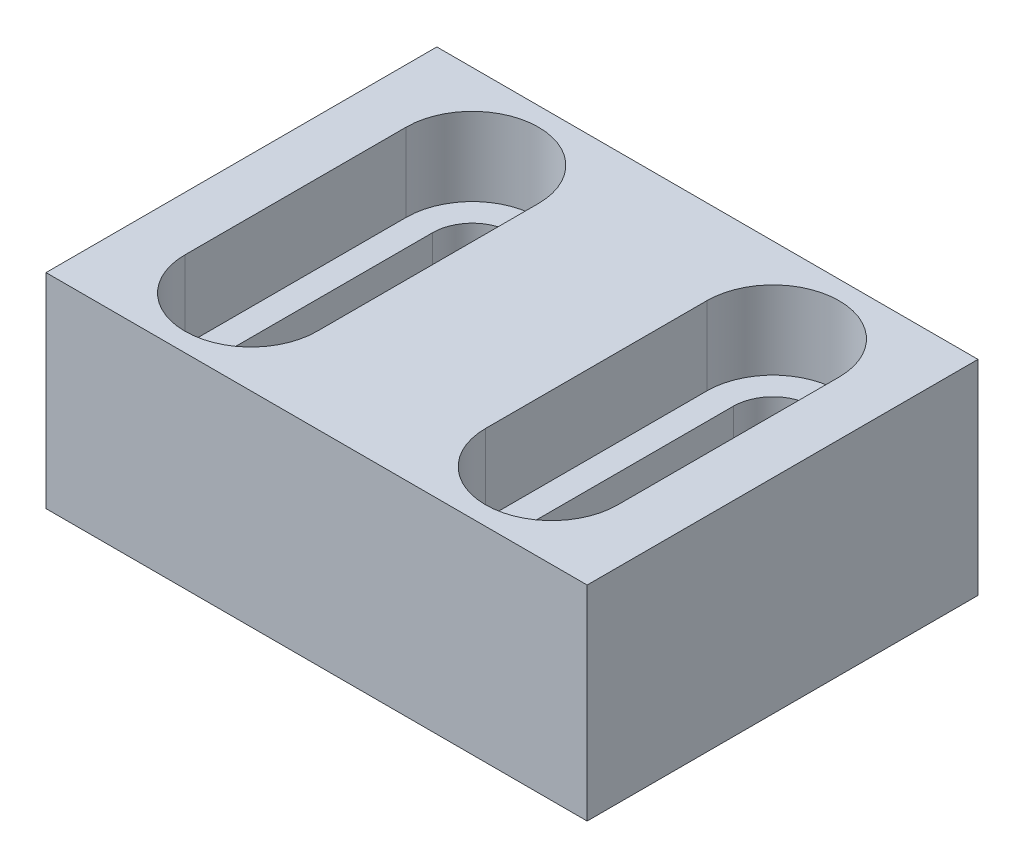
ISO-10303-21;
HEADER;
FILE_DESCRIPTION(('STEP AP214'),'2;1');
FILE_NAME('part.step','',(''),(''),'','','');
FILE_SCHEMA(('AUTOMOTIVE_DESIGN { 1 0 10303 214 1 1 1 1 }'));
ENDSEC;
DATA;
#1=APPLICATION_CONTEXT('core data for automotive mechanical design processes');
#2=APPLICATION_PROTOCOL_DEFINITION('international standard','automotive_design',2000,#1);
#3=PRODUCT_CONTEXT('',#1,'mechanical');
#4=PRODUCT('Part','Part','',(#3));
#5=PRODUCT_RELATED_PRODUCT_CATEGORY('part','',(#4));
#6=PRODUCT_DEFINITION_FORMATION('','',#4);
#7=PRODUCT_DEFINITION_CONTEXT('part definition',#1,'design');
#8=PRODUCT_DEFINITION('design','',#6,#7);
#9=PRODUCT_DEFINITION_SHAPE('','',#8);
#10=(LENGTH_UNIT() NAMED_UNIT(*) SI_UNIT(.MILLI.,.METRE.));
#11=(NAMED_UNIT(*) PLANE_ANGLE_UNIT() SI_UNIT($,.RADIAN.));
#12=(NAMED_UNIT(*) SI_UNIT($,.STERADIAN.) SOLID_ANGLE_UNIT());
#13=UNCERTAINTY_MEASURE_WITH_UNIT(LENGTH_MEASURE(1.E-05),#10,'distance_accuracy_value','');
#14=(GEOMETRIC_REPRESENTATION_CONTEXT(3) GLOBAL_UNCERTAINTY_ASSIGNED_CONTEXT((#13)) GLOBAL_UNIT_ASSIGNED_CONTEXT((#10,
#11,#12)) REPRESENTATION_CONTEXT('',''));
#15=CARTESIAN_POINT('',(0.,0.,0.));
#16=DIRECTION('',(0.,0.,1.));
#17=DIRECTION('',(1.,0.,0.));
#18=AXIS2_PLACEMENT_3D('',#15,#16,#17);
#19=CARTESIAN_POINT('',(-12.5,17.,9.2));
#20=DIRECTION('',(0.,-1.,0.));
#21=DIRECTION('',(0.,0.,-1.));
#22=AXIS2_PLACEMENT_3D('',#19,#20,#21);
#23=CYLINDRICAL_SURFACE('',#22,3.3);
#24=DIRECTION('',(0.,-1.,0.));
#25=VECTOR('',#24,1.);
#26=CARTESIAN_POINT('',(-15.8,17.,9.2));
#27=LINE('',#26,#25);
#28=CARTESIAN_POINT('',(-15.8,10.5,9.2));
#29=VERTEX_POINT('',#28);
#30=CARTESIAN_POINT('',(-15.8,0.,9.2));
#31=VERTEX_POINT('',#30);
#32=EDGE_CURVE('E372',#29,#31,#27,.T.);
#33=ORIENTED_EDGE('',*,*,#32,.F.);
#34=CARTESIAN_POINT('',(-12.5,10.5,9.2));
#35=DIRECTION('',(0.,1.,0.));
#36=DIRECTION('',(0.,0.,1.));
#37=AXIS2_PLACEMENT_3D('',#34,#35,#36);
#38=CIRCLE('',#37,3.3);
#39=CARTESIAN_POINT('',(-9.2,10.5,9.2));
#40=VERTEX_POINT('',#39);
#41=EDGE_CURVE('E324',#29,#40,#38,.T.);
#42=ORIENTED_EDGE('',*,*,#41,.T.);
#43=DIRECTION('',(0.,-1.,0.));
#44=VECTOR('',#43,1.);
#45=CARTESIAN_POINT('',(-9.2,17.,9.2));
#46=LINE('',#45,#44);
#47=CARTESIAN_POINT('',(-9.2,0.,9.2));
#48=VERTEX_POINT('',#47);
#49=EDGE_CURVE('E381',#40,#48,#46,.T.);
#50=ORIENTED_EDGE('',*,*,#49,.T.);
#51=CARTESIAN_POINT('',(-12.5,0.,9.2));
#52=DIRECTION('',(0.,1.,0.));
#53=DIRECTION('',(0.,0.,1.));
#54=AXIS2_PLACEMENT_3D('',#51,#52,#53);
#55=CIRCLE('',#54,3.3);
#56=EDGE_CURVE('E356',#31,#48,#55,.T.);
#57=ORIENTED_EDGE('',*,*,#56,.F.);
#58=EDGE_LOOP('',(#33,#42,#50,#57));
#59=FACE_BOUND('',#58,.T.);
#60=ADVANCED_FACE('F42',(#59),#23,.F.);
#61=CARTESIAN_POINT('',(-9.2,17.,9.2));
#62=DIRECTION('',(-1.,0.,0.));
#63=DIRECTION('',(0.,0.,1.));
#64=AXIS2_PLACEMENT_3D('',#61,#62,#63);
#65=PLANE('',#64);
#66=ORIENTED_EDGE('',*,*,#49,.F.);
#67=DIRECTION('',(0.,0.,-1.));
#68=VECTOR('',#67,1.);
#69=CARTESIAN_POINT('',(-9.2,10.5,9.2));
#70=LINE('',#69,#68);
#71=CARTESIAN_POINT('',(-9.2,10.5,-9.2));
#72=VERTEX_POINT('',#71);
#73=EDGE_CURVE('E320',#40,#72,#70,.T.);
#74=ORIENTED_EDGE('',*,*,#73,.T.);
#75=DIRECTION('',(0.,-1.,0.));
#76=VECTOR('',#75,1.);
#77=CARTESIAN_POINT('',(-9.2,17.,-9.2));
#78=LINE('',#77,#76);
#79=CARTESIAN_POINT('',(-9.2,0.,-9.2));
#80=VERTEX_POINT('',#79);
#81=EDGE_CURVE('E378',#72,#80,#78,.T.);
#82=ORIENTED_EDGE('',*,*,#81,.T.);
#83=DIRECTION('',(0.,0.,-1.));
#84=VECTOR('',#83,1.);
#85=CARTESIAN_POINT('',(-9.2,0.,9.2));
#86=LINE('',#85,#84);
#87=EDGE_CURVE('E360',#48,#80,#86,.T.);
#88=ORIENTED_EDGE('',*,*,#87,.F.);
#89=EDGE_LOOP('',(#66,#74,#82,#88));
#90=FACE_BOUND('',#89,.T.);
#91=ADVANCED_FACE('F458',(#90),#65,.T.);
#92=CARTESIAN_POINT('',(-12.5,17.,-9.2));
#93=DIRECTION('',(0.,-1.,0.));
#94=DIRECTION('',(0.,0.,-1.));
#95=AXIS2_PLACEMENT_3D('',#92,#93,#94);
#96=CYLINDRICAL_SURFACE('',#95,3.3);
#97=ORIENTED_EDGE('',*,*,#81,.F.);
#98=CARTESIAN_POINT('',(-12.5,10.5,-9.2));
#99=DIRECTION('',(0.,1.,0.));
#100=DIRECTION('',(0.,0.,1.));
#101=AXIS2_PLACEMENT_3D('',#98,#99,#100);
#102=CIRCLE('',#101,3.3);
#103=CARTESIAN_POINT('',(-15.8,10.5,-9.2));
#104=VERTEX_POINT('',#103);
#105=EDGE_CURVE('E316',#72,#104,#102,.T.);
#106=ORIENTED_EDGE('',*,*,#105,.T.);
#107=DIRECTION('',(0.,-1.,0.));
#108=VECTOR('',#107,1.);
#109=CARTESIAN_POINT('',(-15.8,17.,-9.2));
#110=LINE('',#109,#108);
#111=CARTESIAN_POINT('',(-15.8,0.,-9.2));
#112=VERTEX_POINT('',#111);
#113=EDGE_CURVE('E375',#104,#112,#110,.T.);
#114=ORIENTED_EDGE('',*,*,#113,.T.);
#115=CARTESIAN_POINT('',(-12.5,0.,-9.2));
#116=DIRECTION('',(0.,1.,0.));
#117=DIRECTION('',(0.,0.,1.));
#118=AXIS2_PLACEMENT_3D('',#115,#116,#117);
#119=CIRCLE('',#118,3.3);
#120=EDGE_CURVE('E364',#80,#112,#119,.T.);
#121=ORIENTED_EDGE('',*,*,#120,.F.);
#122=EDGE_LOOP('',(#97,#106,#114,#121));
#123=FACE_BOUND('',#122,.T.);
#124=ADVANCED_FACE('F464',(#123),#96,.F.);
#125=CARTESIAN_POINT('',(-15.8,17.,9.2));
#126=DIRECTION('',(1.,0.,0.));
#127=DIRECTION('',(0.,0.,-1.));
#128=AXIS2_PLACEMENT_3D('',#125,#126,#127);
#129=PLANE('',#128);
#130=ORIENTED_EDGE('',*,*,#113,.F.);
#131=DIRECTION('',(0.,0.,1.));
#132=VECTOR('',#131,1.);
#133=CARTESIAN_POINT('',(-15.8,10.5,9.2));
#134=LINE('',#133,#132);
#135=EDGE_CURVE('E11',#104,#29,#134,.T.);
#136=ORIENTED_EDGE('',*,*,#135,.T.);
#137=ORIENTED_EDGE('',*,*,#32,.T.);
#138=DIRECTION('',(0.,0.,1.));
#139=VECTOR('',#138,1.);
#140=CARTESIAN_POINT('',(-15.8,0.,9.2));
#141=LINE('',#140,#139);
#142=EDGE_CURVE('E368',#112,#31,#141,.T.);
#143=ORIENTED_EDGE('',*,*,#142,.F.);
#144=EDGE_LOOP('',(#130,#136,#137,#143));
#145=FACE_BOUND('',#144,.T.);
#146=ADVANCED_FACE('F455',(#145),#129,.T.);
#147=CARTESIAN_POINT('',(12.5,17.,9.2));
#148=DIRECTION('',(0.,-1.,0.));
#149=DIRECTION('',(0.,0.,-1.));
#150=AXIS2_PLACEMENT_3D('',#147,#148,#149);
#151=CYLINDRICAL_SURFACE('',#150,3.3);
#152=DIRECTION('',(0.,-1.,0.));
#153=VECTOR('',#152,1.);
#154=CARTESIAN_POINT('',(9.2,17.,9.2));
#155=LINE('',#154,#153);
#156=CARTESIAN_POINT('',(9.2,10.5,9.2));
#157=VERTEX_POINT('',#156);
#158=CARTESIAN_POINT('',(9.2,0.,9.2));
#159=VERTEX_POINT('',#158);
#160=EDGE_CURVE('E344',#157,#159,#155,.T.);
#161=ORIENTED_EDGE('',*,*,#160,.F.);
#162=CARTESIAN_POINT('',(12.5,10.5,9.2));
#163=DIRECTION('',(0.,1.,0.));
#164=DIRECTION('',(0.,0.,1.));
#165=AXIS2_PLACEMENT_3D('',#162,#163,#164);
#166=CIRCLE('',#165,3.3);
#167=CARTESIAN_POINT('',(15.8,10.5,9.2));
#168=VERTEX_POINT('',#167);
#169=EDGE_CURVE('E312',#157,#168,#166,.T.);
#170=ORIENTED_EDGE('',*,*,#169,.T.);
#171=DIRECTION('',(0.,-1.,0.));
#172=VECTOR('',#171,1.);
#173=CARTESIAN_POINT('',(15.8,17.,9.2));
#174=LINE('',#173,#172);
#175=CARTESIAN_POINT('',(15.8,0.,9.2));
#176=VERTEX_POINT('',#175);
#177=EDGE_CURVE('E353',#168,#176,#174,.T.);
#178=ORIENTED_EDGE('',*,*,#177,.T.);
#179=CARTESIAN_POINT('',(12.5,0.,9.2));
#180=DIRECTION('',(0.,1.,0.));
#181=DIRECTION('',(0.,0.,1.));
#182=AXIS2_PLACEMENT_3D('',#179,#180,#181);
#183=CIRCLE('',#182,3.3);
#184=EDGE_CURVE('E328',#159,#176,#183,.T.);
#185=ORIENTED_EDGE('',*,*,#184,.F.);
#186=EDGE_LOOP('',(#161,#170,#178,#185));
#187=FACE_BOUND('',#186,.T.);
#188=ADVANCED_FACE('F435',(#187),#151,.F.);
#189=CARTESIAN_POINT('',(15.8,17.,9.2));
#190=DIRECTION('',(-1.,0.,0.));
#191=DIRECTION('',(0.,0.,1.));
#192=AXIS2_PLACEMENT_3D('',#189,#190,#191);
#193=PLANE('',#192);
#194=ORIENTED_EDGE('',*,*,#177,.F.);
#195=DIRECTION('',(0.,0.,-1.));
#196=VECTOR('',#195,1.);
#197=CARTESIAN_POINT('',(15.8,10.5,9.2));
#198=LINE('',#197,#196);
#199=CARTESIAN_POINT('',(15.8,10.5,-9.2));
#200=VERTEX_POINT('',#199);
#201=EDGE_CURVE('E308',#168,#200,#198,.T.);
#202=ORIENTED_EDGE('',*,*,#201,.T.);
#203=DIRECTION('',(0.,-1.,0.));
#204=VECTOR('',#203,1.);
#205=CARTESIAN_POINT('',(15.8,17.,-9.2));
#206=LINE('',#205,#204);
#207=CARTESIAN_POINT('',(15.8,0.,-9.2));
#208=VERTEX_POINT('',#207);
#209=EDGE_CURVE('E350',#200,#208,#206,.T.);
#210=ORIENTED_EDGE('',*,*,#209,.T.);
#211=DIRECTION('',(0.,0.,-1.));
#212=VECTOR('',#211,1.);
#213=CARTESIAN_POINT('',(15.8,0.,9.2));
#214=LINE('',#213,#212);
#215=EDGE_CURVE('E332',#176,#208,#214,.T.);
#216=ORIENTED_EDGE('',*,*,#215,.F.);
#217=EDGE_LOOP('',(#194,#202,#210,#216));
#218=FACE_BOUND('',#217,.T.);
#219=ADVANCED_FACE('F447',(#218),#193,.T.);
#220=CARTESIAN_POINT('',(12.5,17.,-9.2));
#221=DIRECTION('',(0.,-1.,0.));
#222=DIRECTION('',(0.,0.,-1.));
#223=AXIS2_PLACEMENT_3D('',#220,#221,#222);
#224=CYLINDRICAL_SURFACE('',#223,3.3);
#225=ORIENTED_EDGE('',*,*,#209,.F.);
#226=CARTESIAN_POINT('',(12.5,10.5,-9.2));
#227=DIRECTION('',(0.,1.,0.));
#228=DIRECTION('',(0.,0.,1.));
#229=AXIS2_PLACEMENT_3D('',#226,#227,#228);
#230=CIRCLE('',#229,3.3);
#231=CARTESIAN_POINT('',(9.2,10.5,-9.2));
#232=VERTEX_POINT('',#231);
#233=EDGE_CURVE('E255',#200,#232,#230,.T.);
#234=ORIENTED_EDGE('',*,*,#233,.T.);
#235=DIRECTION('',(0.,-1.,0.));
#236=VECTOR('',#235,1.);
#237=CARTESIAN_POINT('',(9.2,17.,-9.2));
#238=LINE('',#237,#236);
#239=CARTESIAN_POINT('',(9.2,0.,-9.2));
#240=VERTEX_POINT('',#239);
#241=EDGE_CURVE('E347',#232,#240,#238,.T.);
#242=ORIENTED_EDGE('',*,*,#241,.T.);
#243=CARTESIAN_POINT('',(12.5,0.,-9.2));
#244=DIRECTION('',(0.,1.,0.));
#245=DIRECTION('',(0.,0.,1.));
#246=AXIS2_PLACEMENT_3D('',#243,#244,#245);
#247=CIRCLE('',#246,3.3);
#248=EDGE_CURVE('E336',#208,#240,#247,.T.);
#249=ORIENTED_EDGE('',*,*,#248,.F.);
#250=EDGE_LOOP('',(#225,#234,#242,#249));
#251=FACE_BOUND('',#250,.T.);
#252=ADVANCED_FACE('F443',(#251),#224,.F.);
#253=CARTESIAN_POINT('',(9.2,17.,9.2));
#254=DIRECTION('',(1.,0.,0.));
#255=DIRECTION('',(0.,0.,-1.));
#256=AXIS2_PLACEMENT_3D('',#253,#254,#255);
#257=PLANE('',#256);
#258=ORIENTED_EDGE('',*,*,#241,.F.);
#259=DIRECTION('',(0.,0.,1.));
#260=VECTOR('',#259,1.);
#261=CARTESIAN_POINT('',(9.2,10.5,9.2));
#262=LINE('',#261,#260);
#263=EDGE_CURVE('E51',#232,#157,#262,.T.);
#264=ORIENTED_EDGE('',*,*,#263,.T.);
#265=ORIENTED_EDGE('',*,*,#160,.T.);
#266=DIRECTION('',(0.,0.,1.));
#267=VECTOR('',#266,1.);
#268=CARTESIAN_POINT('',(9.2,0.,9.2));
#269=LINE('',#268,#267);
#270=EDGE_CURVE('E340',#240,#159,#269,.T.);
#271=ORIENTED_EDGE('',*,*,#270,.F.);
#272=EDGE_LOOP('',(#258,#264,#265,#271));
#273=FACE_BOUND('',#272,.T.);
#274=ADVANCED_FACE('F430',(#273),#257,.T.);
#275=CARTESIAN_POINT('',(0.,17.,0.));
#276=DIRECTION('',(0.,-1.,0.));
#277=DIRECTION('',(0.,0.,-1.));
#278=AXIS2_PLACEMENT_3D('',#275,#276,#277);
#279=PLANE('',#278);
#280=DIRECTION('',(0.,0.,-1.));
#281=VECTOR('',#280,1.);
#282=CARTESIAN_POINT('',(18.,17.,9.2));
#283=LINE('',#282,#281);
#284=CARTESIAN_POINT('',(18.,17.,9.2));
#285=VERTEX_POINT('',#284);
#286=CARTESIAN_POINT('',(18.,17.,-9.2));
#287=VERTEX_POINT('',#286);
#288=EDGE_CURVE('E240',#285,#287,#283,.T.);
#289=ORIENTED_EDGE('',*,*,#288,.F.);
#290=CARTESIAN_POINT('',(12.5,17.,9.2));
#291=DIRECTION('',(0.,1.,0.));
#292=DIRECTION('',(0.,0.,1.));
#293=AXIS2_PLACEMENT_3D('',#290,#291,#292);
#294=CIRCLE('',#293,5.5);
#295=CARTESIAN_POINT('',(7.,17.,9.2));
#296=VERTEX_POINT('',#295);
#297=EDGE_CURVE('E58',#296,#285,#294,.T.);
#298=ORIENTED_EDGE('',*,*,#297,.F.);
#299=DIRECTION('',(0.,0.,1.));
#300=VECTOR('',#299,1.);
#301=CARTESIAN_POINT('',(7.,17.,-9.2));
#302=LINE('',#301,#300);
#303=CARTESIAN_POINT('',(7.,17.,-9.2));
#304=VERTEX_POINT('',#303);
#305=EDGE_CURVE('E225',#304,#296,#302,.T.);
#306=ORIENTED_EDGE('',*,*,#305,.F.);
#307=CARTESIAN_POINT('',(12.5,17.,-9.2));
#308=DIRECTION('',(0.,1.,0.));
#309=DIRECTION('',(0.,0.,1.));
#310=AXIS2_PLACEMENT_3D('',#307,#308,#309);
#311=CIRCLE('',#310,5.5);
#312=EDGE_CURVE('E245',#287,#304,#311,.T.);
#313=ORIENTED_EDGE('',*,*,#312,.F.);
#314=EDGE_LOOP('',(#289,#298,#306,#313));
#315=FACE_BOUND('',#314,.T.);
#316=DIRECTION('',(0.,0.,-1.));
#317=VECTOR('',#316,1.);
#318=CARTESIAN_POINT('',(-7.,17.,9.2));
#319=LINE('',#318,#317);
#320=CARTESIAN_POINT('',(-7.,17.,9.2));
#321=VERTEX_POINT('',#320);
#322=CARTESIAN_POINT('',(-7.,17.,-9.2));
#323=VERTEX_POINT('',#322);
#324=EDGE_CURVE('E284',#321,#323,#319,.T.);
#325=ORIENTED_EDGE('',*,*,#324,.F.);
#326=CARTESIAN_POINT('',(-12.5,17.,9.2));
#327=DIRECTION('',(0.,1.,0.));
#328=DIRECTION('',(0.,0.,1.));
#329=AXIS2_PLACEMENT_3D('',#326,#327,#328);
#330=CIRCLE('',#329,5.50000000000001);
#331=CARTESIAN_POINT('',(-18.,17.,9.2));
#332=VERTEX_POINT('',#331);
#333=EDGE_CURVE('E66',#332,#321,#330,.T.);
#334=ORIENTED_EDGE('',*,*,#333,.F.);
#335=DIRECTION('',(0.,0.,1.));
#336=VECTOR('',#335,1.);
#337=CARTESIAN_POINT('',(-18.,17.,-9.2));
#338=LINE('',#337,#336);
#339=CARTESIAN_POINT('',(-18.,17.,-9.2));
#340=VERTEX_POINT('',#339);
#341=EDGE_CURVE('E269',#340,#332,#338,.T.);
#342=ORIENTED_EDGE('',*,*,#341,.F.);
#343=CARTESIAN_POINT('',(-12.5,17.,-9.2));
#344=DIRECTION('',(0.,1.,0.));
#345=DIRECTION('',(0.,0.,1.));
#346=AXIS2_PLACEMENT_3D('',#343,#344,#345);
#347=CIRCLE('',#346,5.50000000000001);
#348=EDGE_CURVE('E288',#323,#340,#347,.T.);
#349=ORIENTED_EDGE('',*,*,#348,.F.);
#350=EDGE_LOOP('',(#325,#334,#342,#349));
#351=FACE_BOUND('',#350,.T.);
#352=DIRECTION('',(0.,0.,-1.));
#353=VECTOR('',#352,1.);
#354=CARTESIAN_POINT('',(22.5,17.,16.25));
#355=LINE('',#354,#353);
#356=CARTESIAN_POINT('',(22.5,17.,16.25));
#357=VERTEX_POINT('',#356);
#358=CARTESIAN_POINT('',(22.5,17.,-16.25));
#359=VERTEX_POINT('',#358);
#360=EDGE_CURVE('E385',#357,#359,#355,.T.);
#361=ORIENTED_EDGE('',*,*,#360,.T.);
#362=DIRECTION('',(-1.,0.,0.));
#363=VECTOR('',#362,1.);
#364=CARTESIAN_POINT('',(-22.5,17.,-16.25));
#365=LINE('',#364,#363);
#366=CARTESIAN_POINT('',(-22.5,17.,-16.25));
#367=VERTEX_POINT('',#366);
#368=EDGE_CURVE('E389',#359,#367,#365,.T.);
#369=ORIENTED_EDGE('',*,*,#368,.T.);
#370=DIRECTION('',(0.,0.,1.));
#371=VECTOR('',#370,1.);
#372=CARTESIAN_POINT('',(-22.5,17.,16.25));
#373=LINE('',#372,#371);
#374=CARTESIAN_POINT('',(-22.5,17.,16.25));
#375=VERTEX_POINT('',#374);
#376=EDGE_CURVE('E393',#367,#375,#373,.T.);
#377=ORIENTED_EDGE('',*,*,#376,.T.);
#378=DIRECTION('',(1.,0.,0.));
#379=VECTOR('',#378,1.);
#380=CARTESIAN_POINT('',(-22.5,17.,16.25));
#381=LINE('',#380,#379);
#382=EDGE_CURVE('E396',#375,#357,#381,.T.);
#383=ORIENTED_EDGE('',*,*,#382,.T.);
#384=EDGE_LOOP('',(#361,#369,#377,#383));
#385=FACE_BOUND('',#384,.T.);
#386=ADVANCED_FACE('F470',(#315,#351,#385),#279,.F.);
#387=CARTESIAN_POINT('',(0.,0.,0.));
#388=DIRECTION('',(0.,-1.,0.));
#389=DIRECTION('',(0.,0.,-1.));
#390=AXIS2_PLACEMENT_3D('',#387,#388,#389);
#391=PLANE('',#390);
#392=DIRECTION('',(0.,0.,-1.));
#393=VECTOR('',#392,1.);
#394=CARTESIAN_POINT('',(22.5,0.,16.25));
#395=LINE('',#394,#393);
#396=CARTESIAN_POINT('',(22.5,0.,16.25));
#397=VERTEX_POINT('',#396);
#398=CARTESIAN_POINT('',(22.5,0.,-16.25));
#399=VERTEX_POINT('',#398);
#400=EDGE_CURVE('E384',#397,#399,#395,.T.);
#401=ORIENTED_EDGE('',*,*,#400,.F.);
#402=DIRECTION('',(1.,0.,0.));
#403=VECTOR('',#402,1.);
#404=CARTESIAN_POINT('',(-22.5,0.,16.25));
#405=LINE('',#404,#403);
#406=CARTESIAN_POINT('',(-22.5,0.,16.25));
#407=VERTEX_POINT('',#406);
#408=EDGE_CURVE('E390',#407,#397,#405,.T.);
#409=ORIENTED_EDGE('',*,*,#408,.F.);
#410=DIRECTION('',(0.,0.,1.));
#411=VECTOR('',#410,1.);
#412=CARTESIAN_POINT('',(-22.5,0.,16.25));
#413=LINE('',#412,#411);
#414=CARTESIAN_POINT('',(-22.5,0.,-16.25));
#415=VERTEX_POINT('',#414);
#416=EDGE_CURVE('E406',#415,#407,#413,.T.);
#417=ORIENTED_EDGE('',*,*,#416,.F.);
#418=DIRECTION('',(-1.,0.,0.));
#419=VECTOR('',#418,1.);
#420=CARTESIAN_POINT('',(-22.5,0.,-16.25));
#421=LINE('',#420,#419);
#422=EDGE_CURVE('E403',#399,#415,#421,.T.);
#423=ORIENTED_EDGE('',*,*,#422,.F.);
#424=EDGE_LOOP('',(#401,#409,#417,#423));
#425=FACE_BOUND('',#424,.T.);
#426=ORIENTED_EDGE('',*,*,#142,.T.);
#427=ORIENTED_EDGE('',*,*,#56,.T.);
#428=ORIENTED_EDGE('',*,*,#87,.T.);
#429=ORIENTED_EDGE('',*,*,#120,.T.);
#430=EDGE_LOOP('',(#426,#427,#428,#429));
#431=FACE_BOUND('',#430,.T.);
#432=ORIENTED_EDGE('',*,*,#270,.T.);
#433=ORIENTED_EDGE('',*,*,#184,.T.);
#434=ORIENTED_EDGE('',*,*,#215,.T.);
#435=ORIENTED_EDGE('',*,*,#248,.T.);
#436=EDGE_LOOP('',(#432,#433,#434,#435));
#437=FACE_BOUND('',#436,.T.);
#438=ADVANCED_FACE('F439',(#425,#431,#437),#391,.T.);
#439=CARTESIAN_POINT('',(22.5,17.,16.25));
#440=DIRECTION('',(-1.,0.,0.));
#441=DIRECTION('',(0.,0.,1.));
#442=AXIS2_PLACEMENT_3D('',#439,#440,#441);
#443=PLANE('',#442);
#444=ORIENTED_EDGE('',*,*,#400,.T.);
#445=DIRECTION('',(0.,-1.,0.));
#446=VECTOR('',#445,1.);
#447=CARTESIAN_POINT('',(22.5,17.,-16.25));
#448=LINE('',#447,#446);
#449=EDGE_CURVE('E422',#359,#399,#448,.T.);
#450=ORIENTED_EDGE('',*,*,#449,.F.);
#451=ORIENTED_EDGE('',*,*,#360,.F.);
#452=DIRECTION('',(0.,-1.,0.));
#453=VECTOR('',#452,1.);
#454=CARTESIAN_POINT('',(22.5,17.,16.25));
#455=LINE('',#454,#453);
#456=EDGE_CURVE('E399',#357,#397,#455,.T.);
#457=ORIENTED_EDGE('',*,*,#456,.T.);
#458=EDGE_LOOP('',(#444,#450,#451,#457));
#459=FACE_BOUND('',#458,.T.);
#460=ADVANCED_FACE('F44',(#459),#443,.F.);
#461=CARTESIAN_POINT('',(-22.5,17.,-16.25));
#462=DIRECTION('',(0.,0.,1.));
#463=DIRECTION('',(1.,0.,0.));
#464=AXIS2_PLACEMENT_3D('',#461,#462,#463);
#465=PLANE('',#464);
#466=CARTESIAN_POINT('',(18.5,5.,-16.25));
#467=DIRECTION('',(0.,0.,-1.));
#468=DIRECTION('',(-1.,0.,0.));
#469=AXIS2_PLACEMENT_3D('',#466,#467,#468);
#470=CIRCLE('',#469,1.24999999999999);
#471=CARTESIAN_POINT('',(17.25,5.,-16.25));
#472=VERTEX_POINT('',#471);
#473=EDGE_CURVE('E199',#472,#472,#470,.T.);
#474=ORIENTED_EDGE('',*,*,#473,.F.);
#475=EDGE_LOOP('',(#474));
#476=FACE_BOUND('',#475,.T.);
#477=CARTESIAN_POINT('',(0.,12.,-16.25));
#478=DIRECTION('',(0.,0.,-1.));
#479=DIRECTION('',(-1.,0.,0.));
#480=AXIS2_PLACEMENT_3D('',#477,#478,#479);
#481=CIRCLE('',#480,1.24999999999999);
#482=CARTESIAN_POINT('',(-1.24999999999999,12.,-16.25));
#483=VERTEX_POINT('',#482);
#484=EDGE_CURVE('E198',#483,#483,#481,.T.);
#485=ORIENTED_EDGE('',*,*,#484,.F.);
#486=EDGE_LOOP('',(#485));
#487=FACE_BOUND('',#486,.T.);
#488=CARTESIAN_POINT('',(-18.5,5.,-16.25));
#489=DIRECTION('',(0.,0.,-1.));
#490=DIRECTION('',(-1.,0.,0.));
#491=AXIS2_PLACEMENT_3D('',#488,#489,#490);
#492=CIRCLE('',#491,1.24999999999999);
#493=CARTESIAN_POINT('',(-19.75,5.,-16.25));
#494=VERTEX_POINT('',#493);
#495=EDGE_CURVE('E212',#494,#494,#492,.T.);
#496=ORIENTED_EDGE('',*,*,#495,.F.);
#497=EDGE_LOOP('',(#496));
#498=FACE_BOUND('',#497,.T.);
#499=ORIENTED_EDGE('',*,*,#422,.T.);
#500=DIRECTION('',(0.,-1.,0.));
#501=VECTOR('',#500,1.);
#502=CARTESIAN_POINT('',(-22.5,17.,-16.25));
#503=LINE('',#502,#501);
#504=EDGE_CURVE('E418',#367,#415,#503,.T.);
#505=ORIENTED_EDGE('',*,*,#504,.F.);
#506=ORIENTED_EDGE('',*,*,#368,.F.);
#507=ORIENTED_EDGE('',*,*,#449,.T.);
#508=EDGE_LOOP('',(#499,#505,#506,#507));
#509=FACE_BOUND('',#508,.T.);
#510=ADVANCED_FACE('F484',(#476,#487,#498,#509),#465,.F.);
#511=CARTESIAN_POINT('',(-22.5,17.,16.25));
#512=DIRECTION('',(1.,0.,0.));
#513=DIRECTION('',(0.,0.,-1.));
#514=AXIS2_PLACEMENT_3D('',#511,#512,#513);
#515=PLANE('',#514);
#516=ORIENTED_EDGE('',*,*,#416,.T.);
#517=DIRECTION('',(0.,-1.,0.));
#518=VECTOR('',#517,1.);
#519=CARTESIAN_POINT('',(-22.5,17.,16.25));
#520=LINE('',#519,#518);
#521=EDGE_CURVE('E414',#375,#407,#520,.T.);
#522=ORIENTED_EDGE('',*,*,#521,.F.);
#523=ORIENTED_EDGE('',*,*,#376,.F.);
#524=ORIENTED_EDGE('',*,*,#504,.T.);
#525=EDGE_LOOP('',(#516,#522,#523,#524));
#526=FACE_BOUND('',#525,.T.);
#527=ADVANCED_FACE('F481',(#526),#515,.F.);
#528=CARTESIAN_POINT('',(-22.5,17.,16.25));
#529=DIRECTION('',(0.,0.,-1.));
#530=DIRECTION('',(-1.,0.,0.));
#531=AXIS2_PLACEMENT_3D('',#528,#529,#530);
#532=PLANE('',#531);
#533=ORIENTED_EDGE('',*,*,#408,.T.);
#534=ORIENTED_EDGE('',*,*,#456,.F.);
#535=ORIENTED_EDGE('',*,*,#382,.F.);
#536=ORIENTED_EDGE('',*,*,#521,.T.);
#537=EDGE_LOOP('',(#533,#534,#535,#536));
#538=FACE_BOUND('',#537,.T.);
#539=ADVANCED_FACE('F477',(#538),#532,.F.);
#540=CARTESIAN_POINT('',(12.5,10.5,9.2));
#541=DIRECTION('',(0.,1.,0.));
#542=DIRECTION('',(0.,0.,1.));
#543=AXIS2_PLACEMENT_3D('',#540,#541,#542);
#544=CYLINDRICAL_SURFACE('',#543,5.5);
#545=ORIENTED_EDGE('',*,*,#297,.T.);
#546=DIRECTION('',(0.,1.,0.));
#547=VECTOR('',#546,1.);
#548=CARTESIAN_POINT('',(18.,10.5,9.2));
#549=LINE('',#548,#547);
#550=CARTESIAN_POINT('',(18.,10.5,9.2));
#551=VERTEX_POINT('',#550);
#552=EDGE_CURVE('E237',#551,#285,#549,.T.);
#553=ORIENTED_EDGE('',*,*,#552,.F.);
#554=CARTESIAN_POINT('',(12.5,10.5,9.2));
#555=DIRECTION('',(0.,1.,0.));
#556=DIRECTION('',(0.,0.,1.));
#557=AXIS2_PLACEMENT_3D('',#554,#555,#556);
#558=CIRCLE('',#557,5.5);
#559=CARTESIAN_POINT('',(7.,10.5,9.2));
#560=VERTEX_POINT('',#559);
#561=EDGE_CURVE('E220',#560,#551,#558,.T.);
#562=ORIENTED_EDGE('',*,*,#561,.F.);
#563=DIRECTION('',(0.,1.,0.));
#564=VECTOR('',#563,1.);
#565=CARTESIAN_POINT('',(7.,10.5,9.2));
#566=LINE('',#565,#564);
#567=EDGE_CURVE('E252',#560,#296,#566,.T.);
#568=ORIENTED_EDGE('',*,*,#567,.T.);
#569=EDGE_LOOP('',(#545,#553,#562,#568));
#570=FACE_BOUND('',#569,.T.);
#571=ADVANCED_FACE('F480',(#570),#544,.F.);
#572=CARTESIAN_POINT('',(7.,10.5,-9.2));
#573=DIRECTION('',(-1.,0.,0.));
#574=DIRECTION('',(0.,0.,1.));
#575=AXIS2_PLACEMENT_3D('',#572,#573,#574);
#576=PLANE('',#575);
#577=ORIENTED_EDGE('',*,*,#305,.T.);
#578=ORIENTED_EDGE('',*,*,#567,.F.);
#579=DIRECTION('',(0.,0.,1.));
#580=VECTOR('',#579,1.);
#581=CARTESIAN_POINT('',(7.,10.5,-9.2));
#582=LINE('',#581,#580);
#583=CARTESIAN_POINT('',(7.,10.5,-9.2));
#584=VERTEX_POINT('',#583);
#585=EDGE_CURVE('E233',#584,#560,#582,.T.);
#586=ORIENTED_EDGE('',*,*,#585,.F.);
#587=DIRECTION('',(0.,1.,0.));
#588=VECTOR('',#587,1.);
#589=CARTESIAN_POINT('',(7.,10.5,-9.2));
#590=LINE('',#589,#588);
#591=EDGE_CURVE('E256',#584,#304,#590,.T.);
#592=ORIENTED_EDGE('',*,*,#591,.T.);
#593=EDGE_LOOP('',(#577,#578,#586,#592));
#594=FACE_BOUND('',#593,.T.);
#595=ADVANCED_FACE('F633',(#594),#576,.F.);
#596=CARTESIAN_POINT('',(12.5,10.5,-9.2));
#597=DIRECTION('',(0.,1.,0.));
#598=DIRECTION('',(0.,0.,1.));
#599=AXIS2_PLACEMENT_3D('',#596,#597,#598);
#600=CYLINDRICAL_SURFACE('',#599,5.5);
#601=ORIENTED_EDGE('',*,*,#312,.T.);
#602=ORIENTED_EDGE('',*,*,#591,.F.);
#603=CARTESIAN_POINT('',(12.5,10.5,-9.2));
#604=DIRECTION('',(0.,1.,0.));
#605=DIRECTION('',(0.,0.,1.));
#606=AXIS2_PLACEMENT_3D('',#603,#604,#605);
#607=CIRCLE('',#606,5.5);
#608=CARTESIAN_POINT('',(18.,10.5,-9.2));
#609=VERTEX_POINT('',#608);
#610=EDGE_CURVE('E229',#609,#584,#607,.T.);
#611=ORIENTED_EDGE('',*,*,#610,.F.);
#612=DIRECTION('',(0.,1.,0.));
#613=VECTOR('',#612,1.);
#614=CARTESIAN_POINT('',(18.,10.5,-9.2));
#615=LINE('',#614,#613);
#616=EDGE_CURVE('E259',#609,#287,#615,.T.);
#617=ORIENTED_EDGE('',*,*,#616,.T.);
#618=EDGE_LOOP('',(#601,#602,#611,#617));
#619=FACE_BOUND('',#618,.T.);
#620=ADVANCED_FACE('F640',(#619),#600,.F.);
#621=CARTESIAN_POINT('',(18.,10.5,9.2));
#622=DIRECTION('',(1.,0.,0.));
#623=DIRECTION('',(0.,0.,-1.));
#624=AXIS2_PLACEMENT_3D('',#621,#622,#623);
#625=PLANE('',#624);
#626=ORIENTED_EDGE('',*,*,#288,.T.);
#627=ORIENTED_EDGE('',*,*,#616,.F.);
#628=DIRECTION('',(0.,0.,-1.));
#629=VECTOR('',#628,1.);
#630=CARTESIAN_POINT('',(18.,10.5,9.2));
#631=LINE('',#630,#629);
#632=EDGE_CURVE('E224',#551,#609,#631,.T.);
#633=ORIENTED_EDGE('',*,*,#632,.F.);
#634=ORIENTED_EDGE('',*,*,#552,.T.);
#635=EDGE_LOOP('',(#626,#627,#633,#634));
#636=FACE_BOUND('',#635,.T.);
#637=ADVANCED_FACE('F649',(#636),#625,.F.);
#638=CARTESIAN_POINT('',(12.5,10.5,9.2));
#639=DIRECTION('',(0.,1.,0.));
#640=DIRECTION('',(0.,0.,1.));
#641=AXIS2_PLACEMENT_3D('',#638,#639,#640);
#642=PLANE('',#641);
#643=ORIENTED_EDGE('',*,*,#263,.F.);
#644=ORIENTED_EDGE('',*,*,#233,.F.);
#645=ORIENTED_EDGE('',*,*,#201,.F.);
#646=ORIENTED_EDGE('',*,*,#169,.F.);
#647=EDGE_LOOP('',(#643,#644,#645,#646));
#648=FACE_BOUND('',#647,.T.);
#649=ORIENTED_EDGE('',*,*,#561,.T.);
#650=ORIENTED_EDGE('',*,*,#632,.T.);
#651=ORIENTED_EDGE('',*,*,#610,.T.);
#652=ORIENTED_EDGE('',*,*,#585,.T.);
#653=EDGE_LOOP('',(#649,#650,#651,#652));
#654=FACE_BOUND('',#653,.T.);
#655=ADVANCED_FACE('F444',(#648,#654),#642,.T.);
#656=CARTESIAN_POINT('',(-12.5,10.5,9.2));
#657=DIRECTION('',(0.,1.,0.));
#658=DIRECTION('',(0.,0.,1.));
#659=AXIS2_PLACEMENT_3D('',#656,#657,#658);
#660=CYLINDRICAL_SURFACE('',#659,5.50000000000001);
#661=ORIENTED_EDGE('',*,*,#333,.T.);
#662=DIRECTION('',(0.,1.,0.));
#663=VECTOR('',#662,1.);
#664=CARTESIAN_POINT('',(-7.,10.5,9.2));
#665=LINE('',#664,#663);
#666=CARTESIAN_POINT('',(-7.,10.5,9.2));
#667=VERTEX_POINT('',#666);
#668=EDGE_CURVE('E281',#667,#321,#665,.T.);
#669=ORIENTED_EDGE('',*,*,#668,.F.);
#670=CARTESIAN_POINT('',(-12.5,10.5,9.2));
#671=DIRECTION('',(0.,1.,0.));
#672=DIRECTION('',(0.,0.,1.));
#673=AXIS2_PLACEMENT_3D('',#670,#671,#672);
#674=CIRCLE('',#673,5.50000000000001);
#675=CARTESIAN_POINT('',(-18.,10.5,9.2));
#676=VERTEX_POINT('',#675);
#677=EDGE_CURVE('E264',#676,#667,#674,.T.);
#678=ORIENTED_EDGE('',*,*,#677,.F.);
#679=DIRECTION('',(0.,1.,0.));
#680=VECTOR('',#679,1.);
#681=CARTESIAN_POINT('',(-18.,10.5,9.2));
#682=LINE('',#681,#680);
#683=EDGE_CURVE('E241',#676,#332,#682,.T.);
#684=ORIENTED_EDGE('',*,*,#683,.T.);
#685=EDGE_LOOP('',(#661,#669,#678,#684));
#686=FACE_BOUND('',#685,.T.);
#687=ADVANCED_FACE('F529',(#686),#660,.F.);
#688=CARTESIAN_POINT('',(-18.,10.5,-9.2));
#689=DIRECTION('',(-1.,0.,0.));
#690=DIRECTION('',(0.,0.,1.));
#691=AXIS2_PLACEMENT_3D('',#688,#689,#690);
#692=PLANE('',#691);
#693=ORIENTED_EDGE('',*,*,#341,.T.);
#694=ORIENTED_EDGE('',*,*,#683,.F.);
#695=DIRECTION('',(0.,0.,1.));
#696=VECTOR('',#695,1.);
#697=CARTESIAN_POINT('',(-18.,10.5,-9.2));
#698=LINE('',#697,#696);
#699=CARTESIAN_POINT('',(-18.,10.5,-9.2));
#700=VERTEX_POINT('',#699);
#701=EDGE_CURVE('E277',#700,#676,#698,.T.);
#702=ORIENTED_EDGE('',*,*,#701,.F.);
#703=DIRECTION('',(0.,1.,0.));
#704=VECTOR('',#703,1.);
#705=CARTESIAN_POINT('',(-18.,10.5,-9.2));
#706=LINE('',#705,#704);
#707=EDGE_CURVE('E297',#700,#340,#706,.T.);
#708=ORIENTED_EDGE('',*,*,#707,.T.);
#709=EDGE_LOOP('',(#693,#694,#702,#708));
#710=FACE_BOUND('',#709,.T.);
#711=ADVANCED_FACE('F537',(#710),#692,.F.);
#712=CARTESIAN_POINT('',(-12.5,10.5,-9.2));
#713=DIRECTION('',(0.,1.,0.));
#714=DIRECTION('',(0.,0.,1.));
#715=AXIS2_PLACEMENT_3D('',#712,#713,#714);
#716=CYLINDRICAL_SURFACE('',#715,5.50000000000001);
#717=ORIENTED_EDGE('',*,*,#348,.T.);
#718=ORIENTED_EDGE('',*,*,#707,.F.);
#719=CARTESIAN_POINT('',(-12.5,10.5,-9.2));
#720=DIRECTION('',(0.,1.,0.));
#721=DIRECTION('',(0.,0.,1.));
#722=AXIS2_PLACEMENT_3D('',#719,#720,#721);
#723=CIRCLE('',#722,5.50000000000001);
#724=CARTESIAN_POINT('',(-7.,10.5,-9.2));
#725=VERTEX_POINT('',#724);
#726=EDGE_CURVE('E273',#725,#700,#723,.T.);
#727=ORIENTED_EDGE('',*,*,#726,.F.);
#728=DIRECTION('',(0.,1.,0.));
#729=VECTOR('',#728,1.);
#730=CARTESIAN_POINT('',(-7.,10.5,-9.2));
#731=LINE('',#730,#729);
#732=EDGE_CURVE('E300',#725,#323,#731,.T.);
#733=ORIENTED_EDGE('',*,*,#732,.T.);
#734=EDGE_LOOP('',(#717,#718,#727,#733));
#735=FACE_BOUND('',#734,.T.);
#736=ADVANCED_FACE('F535',(#735),#716,.F.);
#737=CARTESIAN_POINT('',(-7.,10.5,9.2));
#738=DIRECTION('',(1.,0.,0.));
#739=DIRECTION('',(0.,0.,-1.));
#740=AXIS2_PLACEMENT_3D('',#737,#738,#739);
#741=PLANE('',#740);
#742=ORIENTED_EDGE('',*,*,#324,.T.);
#743=ORIENTED_EDGE('',*,*,#732,.F.);
#744=DIRECTION('',(0.,0.,-1.));
#745=VECTOR('',#744,1.);
#746=CARTESIAN_POINT('',(-7.,10.5,9.2));
#747=LINE('',#746,#745);
#748=EDGE_CURVE('E268',#667,#725,#747,.T.);
#749=ORIENTED_EDGE('',*,*,#748,.F.);
#750=ORIENTED_EDGE('',*,*,#668,.T.);
#751=EDGE_LOOP('',(#742,#743,#749,#750));
#752=FACE_BOUND('',#751,.T.);
#753=ADVANCED_FACE('F524',(#752),#741,.F.);
#754=CARTESIAN_POINT('',(-12.5,10.5,9.2));
#755=DIRECTION('',(0.,1.,0.));
#756=DIRECTION('',(0.,0.,1.));
#757=AXIS2_PLACEMENT_3D('',#754,#755,#756);
#758=PLANE('',#757);
#759=ORIENTED_EDGE('',*,*,#135,.F.);
#760=ORIENTED_EDGE('',*,*,#105,.F.);
#761=ORIENTED_EDGE('',*,*,#73,.F.);
#762=ORIENTED_EDGE('',*,*,#41,.F.);
#763=EDGE_LOOP('',(#759,#760,#761,#762));
#764=FACE_BOUND('',#763,.T.);
#765=ORIENTED_EDGE('',*,*,#677,.T.);
#766=ORIENTED_EDGE('',*,*,#748,.T.);
#767=ORIENTED_EDGE('',*,*,#726,.T.);
#768=ORIENTED_EDGE('',*,*,#701,.T.);
#769=EDGE_LOOP('',(#765,#766,#767,#768));
#770=FACE_BOUND('',#769,.T.);
#771=ADVANCED_FACE('F520',(#764,#770),#758,.T.);
#772=CARTESIAN_POINT('',(-18.5,5.,-6.25));
#773=DIRECTION('',(0.,0.,-1.));
#774=DIRECTION('',(-1.,0.,0.));
#775=AXIS2_PLACEMENT_3D('',#772,#773,#774);
#776=CONICAL_SURFACE('',#775,1.25,1.02974425867665);
#777=CARTESIAN_POINT('',(-18.5,5.,-5.49892422621555));
#778=VERTEX_POINT('',#777);
#779=VERTEX_LOOP('',#778);
#780=FACE_BOUND('',#779,.T.);
#781=CARTESIAN_POINT('',(-18.5,5.,-6.25));
#782=DIRECTION('',(0.,0.,-1.));
#783=DIRECTION('',(-1.,0.,0.));
#784=AXIS2_PLACEMENT_3D('',#781,#782,#783);
#785=CIRCLE('',#784,1.25);
#786=CARTESIAN_POINT('',(-19.75,5.,-6.25));
#787=VERTEX_POINT('',#786);
#788=EDGE_CURVE('E216',#787,#787,#785,.T.);
#789=ORIENTED_EDGE('',*,*,#788,.T.);
#790=EDGE_LOOP('',(#789));
#791=FACE_BOUND('',#790,.T.);
#792=ADVANCED_FACE('F523',(#780,#791),#776,.F.);
#793=CARTESIAN_POINT('',(-18.5,5.,-16.25));
#794=DIRECTION('',(0.,0.,-1.));
#795=DIRECTION('',(-1.,0.,0.));
#796=AXIS2_PLACEMENT_3D('',#793,#794,#795);
#797=CYLINDRICAL_SURFACE('',#796,1.24999999999999);
#798=ORIENTED_EDGE('',*,*,#788,.F.);
#799=EDGE_LOOP('',(#798));
#800=FACE_BOUND('',#799,.T.);
#801=ORIENTED_EDGE('',*,*,#495,.T.);
#802=EDGE_LOOP('',(#801));
#803=FACE_BOUND('',#802,.T.);
#804=ADVANCED_FACE('F697',(#800,#803),#797,.F.);
#805=CARTESIAN_POINT('',(0.,12.,-6.25));
#806=DIRECTION('',(0.,0.,-1.));
#807=DIRECTION('',(-1.,0.,0.));
#808=AXIS2_PLACEMENT_3D('',#805,#806,#807);
#809=CONICAL_SURFACE('',#808,1.25,1.02974425867665);
#810=CARTESIAN_POINT('',(0.,12.,-5.49892422621555));
#811=VERTEX_POINT('',#810);
#812=VERTEX_LOOP('',#811);
#813=FACE_BOUND('',#812,.T.);
#814=CARTESIAN_POINT('',(0.,12.,-6.25));
#815=DIRECTION('',(0.,0.,-1.));
#816=DIRECTION('',(-1.,0.,0.));
#817=AXIS2_PLACEMENT_3D('',#814,#815,#816);
#818=CIRCLE('',#817,1.25);
#819=CARTESIAN_POINT('',(-1.25,12.,-6.25));
#820=VERTEX_POINT('',#819);
#821=EDGE_CURVE('E204',#820,#820,#818,.T.);
#822=ORIENTED_EDGE('',*,*,#821,.T.);
#823=EDGE_LOOP('',(#822));
#824=FACE_BOUND('',#823,.T.);
#825=ADVANCED_FACE('F706',(#813,#824),#809,.F.);
#826=CARTESIAN_POINT('',(0.,12.,-16.25));
#827=DIRECTION('',(0.,0.,-1.));
#828=DIRECTION('',(-1.,0.,0.));
#829=AXIS2_PLACEMENT_3D('',#826,#827,#828);
#830=CYLINDRICAL_SURFACE('',#829,1.24999999999999);
#831=ORIENTED_EDGE('',*,*,#821,.F.);
#832=EDGE_LOOP('',(#831));
#833=FACE_BOUND('',#832,.T.);
#834=ORIENTED_EDGE('',*,*,#484,.T.);
#835=EDGE_LOOP('',(#834));
#836=FACE_BOUND('',#835,.T.);
#837=ADVANCED_FACE('F191',(#833,#836),#830,.F.);
#838=CARTESIAN_POINT('',(18.5,5.,-6.25));
#839=DIRECTION('',(0.,0.,-1.));
#840=DIRECTION('',(-1.,0.,0.));
#841=AXIS2_PLACEMENT_3D('',#838,#839,#840);
#842=CONICAL_SURFACE('',#841,1.25,1.02974425867665);
#843=CARTESIAN_POINT('',(18.5,5.,-5.49892422621555));
#844=VERTEX_POINT('',#843);
#845=VERTEX_LOOP('',#844);
#846=FACE_BOUND('',#845,.T.);
#847=CARTESIAN_POINT('',(18.5,5.,-6.25));
#848=DIRECTION('',(0.,0.,-1.));
#849=DIRECTION('',(-1.,0.,0.));
#850=AXIS2_PLACEMENT_3D('',#847,#848,#849);
#851=CIRCLE('',#850,1.25);
#852=CARTESIAN_POINT('',(17.25,5.,-6.25));
#853=VERTEX_POINT('',#852);
#854=EDGE_CURVE('E195',#853,#853,#851,.T.);
#855=ORIENTED_EDGE('',*,*,#854,.T.);
#856=EDGE_LOOP('',(#855));
#857=FACE_BOUND('',#856,.T.);
#858=ADVANCED_FACE('F187',(#846,#857),#842,.F.);
#859=CARTESIAN_POINT('',(18.5,5.,-16.25));
#860=DIRECTION('',(0.,0.,-1.));
#861=DIRECTION('',(-1.,0.,0.));
#862=AXIS2_PLACEMENT_3D('',#859,#860,#861);
#863=CYLINDRICAL_SURFACE('',#862,1.24999999999999);
#864=ORIENTED_EDGE('',*,*,#854,.F.);
#865=EDGE_LOOP('',(#864));
#866=FACE_BOUND('',#865,.T.);
#867=ORIENTED_EDGE('',*,*,#473,.T.);
#868=EDGE_LOOP('',(#867));
#869=FACE_BOUND('',#868,.T.);
#870=ADVANCED_FACE('F190',(#866,#869),#863,.F.);
#871=CLOSED_SHELL('',(#60,#91,#124,#146,#188,#219,#252,#274,#386,#438,#460,#510,#527,#539,#571,
#595,#620,#637,#655,#687,#711,#736,#753,#771,#792,#804,#825,#837,#858,#870));
#872=MANIFOLD_SOLID_BREP('B2',#871);
#873=ADVANCED_BREP_SHAPE_REPRESENTATION('',(#18,#872),#14);
#874=SHAPE_DEFINITION_REPRESENTATION(#9,#873);
ENDSEC;
END-ISO-10303-21;
